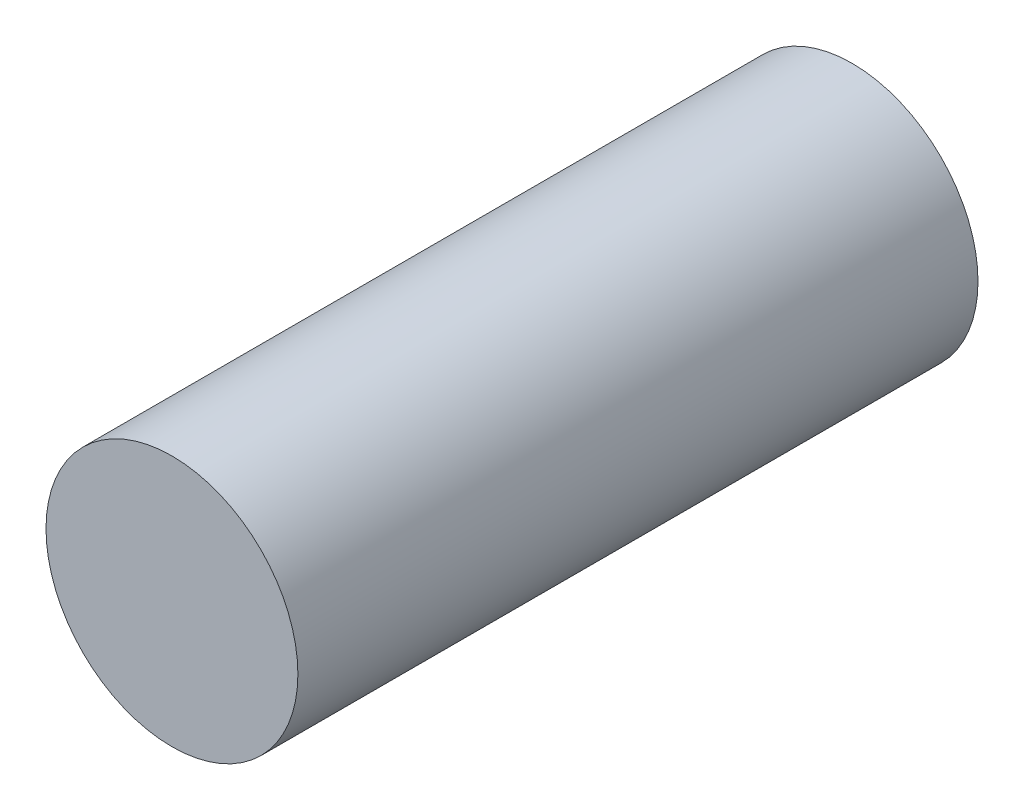
ISO-10303-21;
HEADER;
FILE_DESCRIPTION(('STEP AP214'),'2;1');
FILE_NAME('part.step','',(''),(''),'','','');
FILE_SCHEMA(('AUTOMOTIVE_DESIGN { 1 0 10303 214 1 1 1 1 }'));
ENDSEC;
DATA;
#1=APPLICATION_CONTEXT('core data for automotive mechanical design processes');
#2=APPLICATION_PROTOCOL_DEFINITION('international standard','automotive_design',2000,#1);
#3=PRODUCT_CONTEXT('',#1,'mechanical');
#4=PRODUCT('Part','Part','',(#3));
#5=PRODUCT_RELATED_PRODUCT_CATEGORY('part','',(#4));
#6=PRODUCT_DEFINITION_FORMATION('','',#4);
#7=PRODUCT_DEFINITION_CONTEXT('part definition',#1,'design');
#8=PRODUCT_DEFINITION('design','',#6,#7);
#9=PRODUCT_DEFINITION_SHAPE('','',#8);
#10=(LENGTH_UNIT() NAMED_UNIT(*) SI_UNIT(.MILLI.,.METRE.));
#11=(NAMED_UNIT(*) PLANE_ANGLE_UNIT() SI_UNIT($,.RADIAN.));
#12=(NAMED_UNIT(*) SI_UNIT($,.STERADIAN.) SOLID_ANGLE_UNIT());
#13=UNCERTAINTY_MEASURE_WITH_UNIT(LENGTH_MEASURE(1.E-05),#10,'distance_accuracy_value','');
#14=(GEOMETRIC_REPRESENTATION_CONTEXT(3) GLOBAL_UNCERTAINTY_ASSIGNED_CONTEXT((#13)) GLOBAL_UNIT_ASSIGNED_CONTEXT((#10,
#11,#12)) REPRESENTATION_CONTEXT('',''));
#15=CARTESIAN_POINT('',(0.,0.,0.));
#16=DIRECTION('',(0.,0.,1.));
#17=DIRECTION('',(1.,0.,0.));
#18=AXIS2_PLACEMENT_3D('',#15,#16,#17);
#19=CARTESIAN_POINT('',(0.,0.,34.29));
#20=DIRECTION('',(0.,0.,-1.));
#21=DIRECTION('',(-1.,0.,0.));
#22=AXIS2_PLACEMENT_3D('',#19,#20,#21);
#23=CYLINDRICAL_SURFACE('',#22,6.35);
#24=CARTESIAN_POINT('',(0.,0.,34.29));
#25=DIRECTION('',(0.,0.,1.));
#26=DIRECTION('',(1.,0.,0.));
#27=AXIS2_PLACEMENT_3D('',#24,#25,#26);
#28=CIRCLE('',#27,6.35);
#29=CARTESIAN_POINT('',(6.35,0.,34.29));
#30=VERTEX_POINT('',#29);
#31=EDGE_CURVE('E10',#30,#30,#28,.T.);
#32=ORIENTED_EDGE('',*,*,#31,.F.);
#33=EDGE_LOOP('',(#32));
#34=FACE_BOUND('',#33,.T.);
#35=CARTESIAN_POINT('',(0.,0.,0.));
#36=DIRECTION('',(0.,0.,1.));
#37=DIRECTION('',(1.,0.,0.));
#38=AXIS2_PLACEMENT_3D('',#35,#36,#37);
#39=CIRCLE('',#38,6.35);
#40=CARTESIAN_POINT('',(6.35,0.,0.));
#41=VERTEX_POINT('',#40);
#42=EDGE_CURVE('E34',#41,#41,#39,.T.);
#43=ORIENTED_EDGE('',*,*,#42,.T.);
#44=EDGE_LOOP('',(#43));
#45=FACE_BOUND('',#44,.T.);
#46=ADVANCED_FACE('F31',(#34,#45),#23,.T.);
#47=CARTESIAN_POINT('',(0.,0.,34.29));
#48=DIRECTION('',(0.,0.,1.));
#49=DIRECTION('',(1.,0.,0.));
#50=AXIS2_PLACEMENT_3D('',#47,#48,#49);
#51=PLANE('',#50);
#52=ORIENTED_EDGE('',*,*,#31,.T.);
#53=EDGE_LOOP('',(#52));
#54=FACE_BOUND('',#53,.T.);
#55=ADVANCED_FACE('F46',(#54),#51,.T.);
#56=CARTESIAN_POINT('',(0.,0.,0.));
#57=DIRECTION('',(0.,0.,1.));
#58=DIRECTION('',(1.,0.,0.));
#59=AXIS2_PLACEMENT_3D('',#56,#57,#58);
#60=PLANE('',#59);
#61=ORIENTED_EDGE('',*,*,#42,.F.);
#62=EDGE_LOOP('',(#61));
#63=FACE_BOUND('',#62,.T.);
#64=ADVANCED_FACE('F44',(#63),#60,.F.);
#65=CLOSED_SHELL('',(#46,#55,#64));
#66=MANIFOLD_SOLID_BREP('B2',#65);
#67=ADVANCED_BREP_SHAPE_REPRESENTATION('',(#18,#66),#14);
#68=SHAPE_DEFINITION_REPRESENTATION(#9,#67);
ENDSEC;
END-ISO-10303-21;
